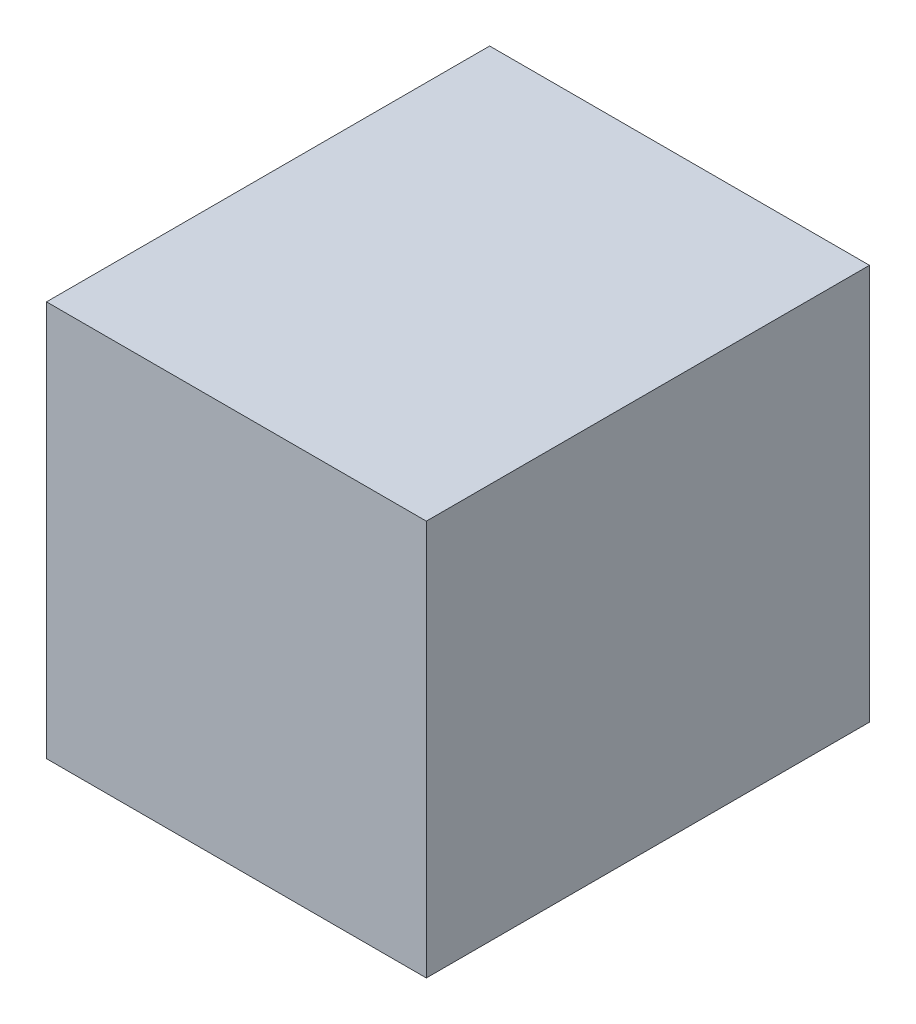
ISO-10303-21;
HEADER;
FILE_DESCRIPTION(('STEP AP214'),'2;1');
FILE_NAME('part.step','',(''),(''),'','','');
FILE_SCHEMA(('AUTOMOTIVE_DESIGN { 1 0 10303 214 1 1 1 1 }'));
ENDSEC;
DATA;
#1=APPLICATION_CONTEXT('core data for automotive mechanical design processes');
#2=APPLICATION_PROTOCOL_DEFINITION('international standard','automotive_design',2000,#1);
#3=PRODUCT_CONTEXT('',#1,'mechanical');
#4=PRODUCT('Part','Part','',(#3));
#5=PRODUCT_RELATED_PRODUCT_CATEGORY('part','',(#4));
#6=PRODUCT_DEFINITION_FORMATION('','',#4);
#7=PRODUCT_DEFINITION_CONTEXT('part definition',#1,'design');
#8=PRODUCT_DEFINITION('design','',#6,#7);
#9=PRODUCT_DEFINITION_SHAPE('','',#8);
#10=(LENGTH_UNIT() NAMED_UNIT(*) SI_UNIT(.MILLI.,.METRE.));
#11=(NAMED_UNIT(*) PLANE_ANGLE_UNIT() SI_UNIT($,.RADIAN.));
#12=(NAMED_UNIT(*) SI_UNIT($,.STERADIAN.) SOLID_ANGLE_UNIT());
#13=UNCERTAINTY_MEASURE_WITH_UNIT(LENGTH_MEASURE(1.E-05),#10,'distance_accuracy_value','');
#14=(GEOMETRIC_REPRESENTATION_CONTEXT(3) GLOBAL_UNCERTAINTY_ASSIGNED_CONTEXT((#13)) GLOBAL_UNIT_ASSIGNED_CONTEXT((#10,
#11,#12)) REPRESENTATION_CONTEXT('',''));
#15=CARTESIAN_POINT('',(0.,0.,0.));
#16=DIRECTION('',(0.,0.,1.));
#17=DIRECTION('',(1.,0.,0.));
#18=AXIS2_PLACEMENT_3D('',#15,#16,#17);
#19=CARTESIAN_POINT('',(0.5999988,-0.62500002,0.));
#20=DIRECTION('',(-1.,0.,0.));
#21=DIRECTION('',(0.,0.,1.));
#22=AXIS2_PLACEMENT_3D('',#19,#20,#21);
#23=PLANE('',#22);
#24=DIRECTION('',(0.,0.,-1.));
#25=VECTOR('',#24,1.);
#26=CARTESIAN_POINT('',(0.5999988,0.62500002,0.));
#27=LINE('',#26,#25);
#28=CARTESIAN_POINT('',(0.5999988,0.62500002,0.));
#29=VERTEX_POINT('',#28);
#30=CARTESIAN_POINT('',(0.5999988,0.62500002,1.39999974));
#31=VERTEX_POINT('',#30);
#32=EDGE_CURVE('E20',#29,#31,#27,.F.);
#33=ORIENTED_EDGE('',*,*,#32,.T.);
#34=DIRECTION('',(0.,1.,0.));
#35=VECTOR('',#34,1.);
#36=CARTESIAN_POINT('',(0.5999988,0.62500002,1.39999974));
#37=LINE('',#36,#35);
#38=CARTESIAN_POINT('',(0.5999988,-0.62500002,1.39999974));
#39=VERTEX_POINT('',#38);
#40=EDGE_CURVE('E55',#31,#39,#37,.F.);
#41=ORIENTED_EDGE('',*,*,#40,.T.);
#42=DIRECTION('',(0.,0.,1.));
#43=VECTOR('',#42,1.);
#44=CARTESIAN_POINT('',(0.5999988,-0.62500002,0.));
#45=LINE('',#44,#43);
#46=CARTESIAN_POINT('',(0.5999988,-0.62500002,0.));
#47=VERTEX_POINT('',#46);
#48=EDGE_CURVE('E74',#39,#47,#45,.F.);
#49=ORIENTED_EDGE('',*,*,#48,.T.);
#50=DIRECTION('',(0.,1.,0.));
#51=VECTOR('',#50,1.);
#52=CARTESIAN_POINT('',(0.5999988,0.62500002,0.));
#53=LINE('',#52,#51);
#54=EDGE_CURVE('E66',#29,#47,#53,.F.);
#55=ORIENTED_EDGE('',*,*,#54,.F.);
#56=EDGE_LOOP('',(#33,#41,#49,#55));
#57=FACE_BOUND('',#56,.T.);
#58=ADVANCED_FACE('F17',(#57),#23,.F.);
#59=CARTESIAN_POINT('',(0.5999988,0.62500002,0.));
#60=DIRECTION('',(0.,-1.,0.));
#61=DIRECTION('',(0.,0.,-1.));
#62=AXIS2_PLACEMENT_3D('',#59,#60,#61);
#63=PLANE('',#62);
#64=DIRECTION('',(0.,0.,-1.));
#65=VECTOR('',#64,1.);
#66=CARTESIAN_POINT('',(-0.5999988,0.62500002,0.));
#67=LINE('',#66,#65);
#68=CARTESIAN_POINT('',(-0.5999988,0.62500002,0.));
#69=VERTEX_POINT('',#68);
#70=CARTESIAN_POINT('',(-0.5999988,0.62500002,1.39999974));
#71=VERTEX_POINT('',#70);
#72=EDGE_CURVE('E72',#69,#71,#67,.F.);
#73=ORIENTED_EDGE('',*,*,#72,.T.);
#74=DIRECTION('',(-1.,0.,0.));
#75=VECTOR('',#74,1.);
#76=CARTESIAN_POINT('',(0.5999988,0.62500002,1.39999974));
#77=LINE('',#76,#75);
#78=EDGE_CURVE('E62',#71,#31,#77,.F.);
#79=ORIENTED_EDGE('',*,*,#78,.T.);
#80=ORIENTED_EDGE('',*,*,#32,.F.);
#81=DIRECTION('',(-1.,0.,0.));
#82=VECTOR('',#81,1.);
#83=CARTESIAN_POINT('',(0.5999988,0.62500002,0.));
#84=LINE('',#83,#82);
#85=EDGE_CURVE('E80',#69,#29,#84,.F.);
#86=ORIENTED_EDGE('',*,*,#85,.F.);
#87=EDGE_LOOP('',(#73,#79,#80,#86));
#88=FACE_BOUND('',#87,.T.);
#89=ADVANCED_FACE('F71',(#88),#63,.F.);
#90=CARTESIAN_POINT('',(0.5999988,0.62500002,1.39999974));
#91=DIRECTION('',(0.,0.,-1.));
#92=DIRECTION('',(-1.,0.,0.));
#93=AXIS2_PLACEMENT_3D('',#90,#91,#92);
#94=PLANE('',#93);
#95=DIRECTION('',(0.,1.,0.));
#96=VECTOR('',#95,1.);
#97=CARTESIAN_POINT('',(-0.5999988,0.62500002,1.39999974));
#98=LINE('',#97,#96);
#99=CARTESIAN_POINT('',(-0.5999988,-0.62500002,1.39999974));
#100=VERTEX_POINT('',#99);
#101=EDGE_CURVE('E83',#71,#100,#98,.F.);
#102=ORIENTED_EDGE('',*,*,#101,.T.);
#103=DIRECTION('',(1.,0.,0.));
#104=VECTOR('',#103,1.);
#105=CARTESIAN_POINT('',(-0.5999988,-0.62500002,1.39999974));
#106=LINE('',#105,#104);
#107=EDGE_CURVE('E64',#100,#39,#106,.T.);
#108=ORIENTED_EDGE('',*,*,#107,.T.);
#109=ORIENTED_EDGE('',*,*,#40,.F.);
#110=ORIENTED_EDGE('',*,*,#78,.F.);
#111=EDGE_LOOP('',(#102,#108,#109,#110));
#112=FACE_BOUND('',#111,.T.);
#113=ADVANCED_FACE('F60',(#112),#94,.F.);
#114=CARTESIAN_POINT('',(-0.5999988,-0.62500002,0.));
#115=DIRECTION('',(0.,1.,0.));
#116=DIRECTION('',(0.,0.,1.));
#117=AXIS2_PLACEMENT_3D('',#114,#115,#116);
#118=PLANE('',#117);
#119=ORIENTED_EDGE('',*,*,#48,.F.);
#120=ORIENTED_EDGE('',*,*,#107,.F.);
#121=DIRECTION('',(0.,0.,-1.));
#122=VECTOR('',#121,1.);
#123=CARTESIAN_POINT('',(-0.5999988,-0.62500002,0.));
#124=LINE('',#123,#122);
#125=CARTESIAN_POINT('',(-0.5999988,-0.62500002,0.));
#126=VERTEX_POINT('',#125);
#127=EDGE_CURVE('E26',#100,#126,#124,.T.);
#128=ORIENTED_EDGE('',*,*,#127,.T.);
#129=DIRECTION('',(-1.,0.,0.));
#130=VECTOR('',#129,1.);
#131=CARTESIAN_POINT('',(0.5999988,-0.62500002,0.));
#132=LINE('',#131,#130);
#133=EDGE_CURVE('E34',#47,#126,#132,.T.);
#134=ORIENTED_EDGE('',*,*,#133,.F.);
#135=EDGE_LOOP('',(#119,#120,#128,#134));
#136=FACE_BOUND('',#135,.T.);
#137=ADVANCED_FACE('F88',(#136),#118,.F.);
#138=CARTESIAN_POINT('',(0.5999988,0.62500002,0.));
#139=DIRECTION('',(0.,0.,-1.));
#140=DIRECTION('',(-1.,0.,0.));
#141=AXIS2_PLACEMENT_3D('',#138,#139,#140);
#142=PLANE('',#141);
#143=DIRECTION('',(0.,1.,0.));
#144=VECTOR('',#143,1.);
#145=CARTESIAN_POINT('',(-0.5999988,0.62500002,0.));
#146=LINE('',#145,#144);
#147=EDGE_CURVE('E11',#126,#69,#146,.T.);
#148=ORIENTED_EDGE('',*,*,#147,.T.);
#149=ORIENTED_EDGE('',*,*,#85,.T.);
#150=ORIENTED_EDGE('',*,*,#54,.T.);
#151=ORIENTED_EDGE('',*,*,#133,.T.);
#152=EDGE_LOOP('',(#148,#149,#150,#151));
#153=FACE_BOUND('',#152,.T.);
#154=ADVANCED_FACE('F91',(#153),#142,.T.);
#155=CARTESIAN_POINT('',(-0.5999988,0.62500002,0.));
#156=DIRECTION('',(1.,0.,0.));
#157=DIRECTION('',(0.,0.,-1.));
#158=AXIS2_PLACEMENT_3D('',#155,#156,#157);
#159=PLANE('',#158);
#160=ORIENTED_EDGE('',*,*,#127,.F.);
#161=ORIENTED_EDGE('',*,*,#101,.F.);
#162=ORIENTED_EDGE('',*,*,#72,.F.);
#163=ORIENTED_EDGE('',*,*,#147,.F.);
#164=EDGE_LOOP('',(#160,#161,#162,#163));
#165=FACE_BOUND('',#164,.T.);
#166=ADVANCED_FACE('F90',(#165),#159,.F.);
#167=CLOSED_SHELL('',(#58,#89,#113,#137,#154,#166));
#168=MANIFOLD_SOLID_BREP('B1',#167);
#169=ADVANCED_BREP_SHAPE_REPRESENTATION('',(#18,#168),#14);
#170=SHAPE_DEFINITION_REPRESENTATION(#9,#169);
ENDSEC;
END-ISO-10303-21;
